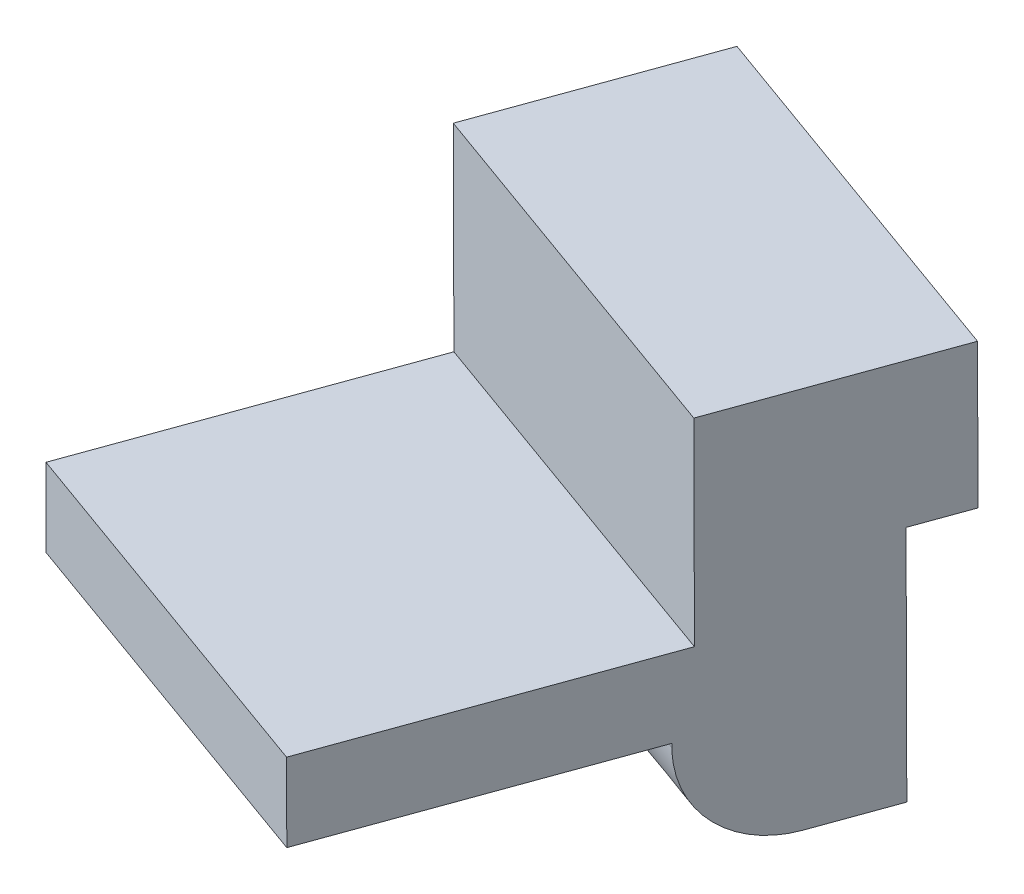
ISO-10303-21;
HEADER;
FILE_DESCRIPTION(('STEP AP214'),'2;1');
FILE_NAME('part.step','',(''),(''),'','','');
FILE_SCHEMA(('AUTOMOTIVE_DESIGN { 1 0 10303 214 1 1 1 1 }'));
ENDSEC;
DATA;
#1=APPLICATION_CONTEXT('core data for automotive mechanical design processes');
#2=APPLICATION_PROTOCOL_DEFINITION('international standard','automotive_design',2000,#1);
#3=PRODUCT_CONTEXT('',#1,'mechanical');
#4=PRODUCT('Part','Part','',(#3));
#5=PRODUCT_RELATED_PRODUCT_CATEGORY('part','',(#4));
#6=PRODUCT_DEFINITION_FORMATION('','',#4);
#7=PRODUCT_DEFINITION_CONTEXT('part definition',#1,'design');
#8=PRODUCT_DEFINITION('design','',#6,#7);
#9=PRODUCT_DEFINITION_SHAPE('','',#8);
#10=(LENGTH_UNIT() NAMED_UNIT(*) SI_UNIT(.MILLI.,.METRE.));
#11=(NAMED_UNIT(*) PLANE_ANGLE_UNIT() SI_UNIT($,.RADIAN.));
#12=(NAMED_UNIT(*) SI_UNIT($,.STERADIAN.) SOLID_ANGLE_UNIT());
#13=UNCERTAINTY_MEASURE_WITH_UNIT(LENGTH_MEASURE(1.E-05),#10,'distance_accuracy_value','');
#14=(GEOMETRIC_REPRESENTATION_CONTEXT(3) GLOBAL_UNCERTAINTY_ASSIGNED_CONTEXT((#13)) GLOBAL_UNIT_ASSIGNED_CONTEXT((#10,
#11,#12)) REPRESENTATION_CONTEXT('',''));
#15=CARTESIAN_POINT('',(0.,0.,0.));
#16=DIRECTION('',(0.,0.,1.));
#17=DIRECTION('',(1.,0.,0.));
#18=AXIS2_PLACEMENT_3D('',#15,#16,#17);
#19=CARTESIAN_POINT('',(190.1243935619,77.6598486218313,-222.834022890715));
#20=DIRECTION('',(-0.340654989155963,-0.000648546510536253,0.940188150186214));
#21=DIRECTION('',(0.00390183466063531,-0.999992125768939,0.000723938118281007));
#22=AXIS2_PLACEMENT_3D('',#19,#20,#21);
#23=PLANE('',#22);
#24=DIRECTION('',(-0.940180277419997,-0.00391507184373129,-0.340654837280959));
#25=VECTOR('',#24,1.);
#26=CARTESIAN_POINT('',(180.93032301511,84.6216215515205,-226.160475120867));
#27=LINE('',#26,#25);
#28=CARTESIAN_POINT('',(190.09708071977,84.6597935019978,-222.83909045722));
#29=VERTEX_POINT('',#28);
#30=CARTESIAN_POINT('',(171.763565309449,84.5834496010601,-229.481859784513));
#31=VERTEX_POINT('',#30);
#32=EDGE_CURVE('E35',#29,#31,#27,.T.);
#33=ORIENTED_EDGE('',*,*,#32,.F.);
#34=DIRECTION('',(0.00390183466064132,-0.999992125768939,0.000723938118264289));
#35=VECTOR('',#34,1.);
#36=CARTESIAN_POINT('',(190.110737140835,81.1598210619171,-222.836556674467));
#37=LINE('',#36,#35);
#38=CARTESIAN_POINT('',(190.1243935619,77.6598486218313,-222.834022890715));
#39=VERTEX_POINT('',#38);
#40=EDGE_CURVE('E11',#29,#39,#37,.T.);
#41=ORIENTED_EDGE('',*,*,#40,.T.);
#42=DIRECTION('',(-0.940180277419997,-0.00391507184373129,-0.340654837280959));
#43=VECTOR('',#42,1.);
#44=CARTESIAN_POINT('',(180.95763585724,77.621676671354,-226.155407554363));
#45=LINE('',#44,#43);
#46=CARTESIAN_POINT('',(171.79087815258,77.5835047208766,-229.47679221801));
#47=VERTEX_POINT('',#46);
#48=EDGE_CURVE('E27',#39,#47,#45,.T.);
#49=ORIENTED_EDGE('',*,*,#48,.T.);
#50=DIRECTION('',(0.00390183466064132,-0.999992125768939,0.000723938118264289));
#51=VECTOR('',#50,1.);
#52=CARTESIAN_POINT('',(171.777221731515,81.0834771609574,-229.479326000762));
#53=LINE('',#52,#51);
#54=EDGE_CURVE('E117',#31,#47,#53,.T.);
#55=ORIENTED_EDGE('',*,*,#54,.F.);
#56=EDGE_LOOP('',(#33,#41,#49,#55));
#57=FACE_BOUND('',#56,.T.);
#58=ADVANCED_FACE('F17',(#57),#23,.F.);
#59=CARTESIAN_POINT('',(189.194547742424,77.658078361247,-220.267701981886));
#60=DIRECTION('',(-0.00390183461032822,0.999992125769035,-0.000723938257071914));
#61=DIRECTION('',(-0.34065498915266,-0.000648546362894274,0.940188150187512));
#62=AXIS2_PLACEMENT_3D('',#59,#60,#61);
#63=PLANE('',#62);
#64=ORIENTED_EDGE('',*,*,#48,.F.);
#65=DIRECTION('',(-0.34065498915266,-0.000648546362876715,0.940188150187512));
#66=VECTOR('',#65,1.);
#67=CARTESIAN_POINT('',(189.659470651662,77.6589634915476,-221.5508624363));
#68=LINE('',#67,#66);
#69=CARTESIAN_POINT('',(189.194547742424,77.658078361247,-220.267701981886));
#70=VERTEX_POINT('',#69);
#71=EDGE_CURVE('E123',#39,#70,#68,.T.);
#72=ORIENTED_EDGE('',*,*,#71,.T.);
#73=DIRECTION('',(-0.940180277421394,-0.00391507184373613,-0.340654837277103));
#74=VECTOR('',#73,1.);
#75=CARTESIAN_POINT('',(180.027790037763,77.6199064107696,-223.589086645533));
#76=LINE('',#75,#74);
#77=CARTESIAN_POINT('',(170.861032332102,77.5817344603093,-226.910471309179));
#78=VERTEX_POINT('',#77);
#79=EDGE_CURVE('E127',#70,#78,#76,.T.);
#80=ORIENTED_EDGE('',*,*,#79,.T.);
#81=DIRECTION('',(-0.34065498915266,-0.000648546362876715,0.940188150187512));
#82=VECTOR('',#81,1.);
#83=CARTESIAN_POINT('',(171.325955242341,77.5826195905929,-228.193631763595));
#84=LINE('',#83,#82);
#85=EDGE_CURVE('E119',#47,#78,#84,.T.);
#86=ORIENTED_EDGE('',*,*,#85,.F.);
#87=EDGE_LOOP('',(#64,#72,#80,#86));
#88=FACE_BOUND('',#87,.T.);
#89=ADVANCED_FACE('F235',(#88),#63,.F.);
#90=CARTESIAN_POINT('',(189.239550660828,66.1243849164435,-220.259352235103));
#91=DIRECTION('',(-0.340654989145949,-0.000648546389706045,0.940188150189925));
#92=DIRECTION('',(0.00390183461948898,-0.999992125769018,0.00072393823184417));
#93=AXIS2_PLACEMENT_3D('',#90,#91,#92);
#94=PLANE('',#93);
#95=ORIENTED_EDGE('',*,*,#79,.F.);
#96=DIRECTION('',(0.00390183461949427,-0.999992125769018,0.000723938231829596));
#97=VECTOR('',#96,1.);
#98=CARTESIAN_POINT('',(189.217049201626,71.8912316388978,-220.263527108994));
#99=LINE('',#98,#97);
#100=CARTESIAN_POINT('',(189.239550660828,66.1243849164435,-220.259352235103));
#101=VERTEX_POINT('',#100);
#102=EDGE_CURVE('E130',#70,#101,#99,.T.);
#103=ORIENTED_EDGE('',*,*,#102,.T.);
#104=DIRECTION('',(-0.940180277423664,-0.00391507184371237,-0.340654837270838));
#105=VECTOR('',#104,1.);
#106=CARTESIAN_POINT('',(180.072792956168,66.0862129659612,-223.580736897751));
#107=LINE('',#106,#105);
#108=CARTESIAN_POINT('',(170.906035251507,66.0480410154838,-226.902121561398));
#109=VERTEX_POINT('',#108);
#110=EDGE_CURVE('E135',#101,#109,#107,.T.);
#111=ORIENTED_EDGE('',*,*,#110,.T.);
#112=DIRECTION('',(0.00390183461949427,-0.999992125769018,0.000723938231829596));
#113=VECTOR('',#112,1.);
#114=CARTESIAN_POINT('',(170.883533792306,71.814887737938,-226.906296435289));
#115=LINE('',#114,#113);
#116=EDGE_CURVE('E132',#78,#109,#115,.T.);
#117=ORIENTED_EDGE('',*,*,#116,.F.);
#118=EDGE_LOOP('',(#95,#103,#111,#117));
#119=FACE_BOUND('',#118,.T.);
#120=ADVANCED_FACE('F239',(#119),#94,.F.);
#121=CARTESIAN_POINT('',(187.893963454222,66.1218231581741,-216.545609041848));
#122=DIRECTION('',(-0.00390183462676691,0.999992125769004,-0.000723938211509815));
#123=DIRECTION('',(-0.340654989152249,-0.000648546411329851,0.940188150187628));
#124=AXIS2_PLACEMENT_3D('',#121,#122,#123);
#125=PLANE('',#124);
#126=ORIENTED_EDGE('',*,*,#110,.F.);
#127=DIRECTION('',(-0.340654989152249,-0.000648546411350677,0.940188150187628));
#128=VECTOR('',#127,1.);
#129=CARTESIAN_POINT('',(188.566757057025,66.1231040373148,-218.402480637975));
#130=LINE('',#129,#128);
#131=CARTESIAN_POINT('',(187.893963454222,66.1218231581741,-216.545609041848));
#132=VERTEX_POINT('',#131);
#133=EDGE_CURVE('E138',#101,#132,#130,.T.);
#134=ORIENTED_EDGE('',*,*,#133,.T.);
#135=DIRECTION('',(-0.940180277421394,-0.00391507184373613,-0.340654837277103));
#136=VECTOR('',#135,1.);
#137=CARTESIAN_POINT('',(178.727205749562,66.0836512076968,-219.866993705495));
#138=LINE('',#137,#136);
#139=CARTESIAN_POINT('',(169.560448043901,66.0454792572364,-223.188378369141));
#140=VERTEX_POINT('',#139);
#141=EDGE_CURVE('E143',#132,#140,#138,.T.);
#142=ORIENTED_EDGE('',*,*,#141,.T.);
#143=DIRECTION('',(-0.340654989152249,-0.000648546411350677,0.940188150187628));
#144=VECTOR('',#143,1.);
#145=CARTESIAN_POINT('',(170.233241647705,66.0467601363601,-225.04524996527));
#146=LINE('',#145,#144);
#147=EDGE_CURVE('E140',#109,#140,#146,.T.);
#148=ORIENTED_EDGE('',*,*,#147,.F.);
#149=EDGE_LOOP('',(#126,#134,#142,#148));
#150=FACE_BOUND('',#149,.T.);
#151=ADVANCED_FACE('F165',(#150),#125,.F.);
#152=CARTESIAN_POINT('',(186.188407176309,71.0685738759847,-211.895261193052));
#153=CARTESIAN_POINT('',(186.194474873758,69.5134977575954,-211.894135405244));
#154=CARTESIAN_POINT('',(186.407981323689,67.9573656585796,-212.46551194947));
#155=CARTESIAN_POINT('',(186.831596054553,66.7287245983908,-213.620534435435));
#156=CARTESIAN_POINT('',(187.364214844212,66.1208146111974,-215.083533389898));
#157=CARTESIAN_POINT('',(187.893963454222,66.1218231581741,-216.545609041848));
#158=B_SPLINE_CURVE_WITH_KNOTS('',5,(#152,#153,#154,#155,#156,#157),.UNSPECIFIED.,.F.,.F.,(6,6),
(0.,1.),.UNSPECIFIED.);
#159=DIRECTION('',(-0.940180277421394,-0.00391507184373613,-0.340654837277103));
#160=VECTOR('',#159,1.);
#161=SURFACE_OF_LINEAR_EXTRUSION('',#158,#160);
#162=ORIENTED_EDGE('',*,*,#141,.F.);
#163=CARTESIAN_POINT('',(187.893963454222,66.1218231581741,-216.545609041848));
#164=CARTESIAN_POINT('',(187.364214844212,66.1208146111974,-215.083533389898));
#165=CARTESIAN_POINT('',(186.831596054553,66.7287245983908,-213.620534435435));
#166=CARTESIAN_POINT('',(186.407981323689,67.9573656585796,-212.46551194947));
#167=CARTESIAN_POINT('',(186.194474873758,69.5134977575954,-211.894135405244));
#168=CARTESIAN_POINT('',(186.188407176309,71.0685738759847,-211.895261193052));
#169=B_SPLINE_CURVE_WITH_KNOTS('',5,(#163,#164,#165,#166,#167,#168),.UNSPECIFIED.,.F.,.F.,(6,6),
(0.,1.),.UNSPECIFIED.);
#170=CARTESIAN_POINT('',(186.188407176309,71.0685738759847,-211.895261193052));
#171=VERTEX_POINT('',#170);
#172=EDGE_CURVE('E146',#132,#171,#169,.T.);
#173=ORIENTED_EDGE('',*,*,#172,.T.);
#174=DIRECTION('',(-0.940180277421394,-0.00391507184373613,-0.340654837277103));
#175=VECTOR('',#174,1.);
#176=CARTESIAN_POINT('',(177.02164947165,71.0304019255023,-215.216645855699));
#177=LINE('',#176,#175);
#178=CARTESIAN_POINT('',(167.85489176699,70.992229975025,-218.538030519346));
#179=VERTEX_POINT('',#178);
#180=EDGE_CURVE('E189',#171,#179,#177,.T.);
#181=ORIENTED_EDGE('',*,*,#180,.T.);
#182=CARTESIAN_POINT('',(169.560448043901,66.0454792572364,-223.188378369141));
#183=CARTESIAN_POINT('',(169.030699434891,66.0444707102428,-221.726302717193));
#184=CARTESIAN_POINT('',(168.498080644232,66.6523806974531,-220.263303762728));
#185=CARTESIAN_POINT('',(168.074465913368,67.8810217576419,-219.108281276763));
#186=CARTESIAN_POINT('',(167.860959464438,69.4371538566357,-218.536904731539));
#187=CARTESIAN_POINT('',(167.85489176699,70.992229975025,-218.538030519346));
#188=B_SPLINE_CURVE_WITH_KNOTS('',5,(#182,#183,#184,#185,#186,#187),.UNSPECIFIED.,.F.,.F.,(6,6),
(0.,1.),.UNSPECIFIED.);
#189=EDGE_CURVE('E148',#140,#179,#188,.T.);
#190=ORIENTED_EDGE('',*,*,#189,.F.);
#191=EDGE_LOOP('',(#162,#173,#181,#190));
#192=FACE_BOUND('',#191,.T.);
#193=ADVANCED_FACE('F160',(#192),#161,.F.);
#194=CARTESIAN_POINT('',(186.188852722872,71.2523589066336,-211.898603065746));
#195=CARTESIAN_POINT('',(186.188531072194,71.2156183568569,-211.897293086242));
#196=CARTESIAN_POINT('',(186.188325681953,71.1788653544517,-211.896303832351));
#197=CARTESIAN_POINT('',(186.188236562692,71.1421041237842,-211.895635380842));
#198=CARTESIAN_POINT('',(186.188263723963,71.1053388894381,-211.895287808487));
#199=CARTESIAN_POINT('',(186.188407176309,71.0685738759847,-211.895261193052));
#200=B_SPLINE_CURVE_WITH_KNOTS('',5,(#194,#195,#196,#197,#198,#199),.UNSPECIFIED.,.F.,.F.,(6,6),
(0.,1.),.UNSPECIFIED.);
#201=DIRECTION('',(-0.940180277421394,-0.00391507184373613,-0.340654837277103));
#202=VECTOR('',#201,1.);
#203=SURFACE_OF_LINEAR_EXTRUSION('',#200,#202);
#204=ORIENTED_EDGE('',*,*,#180,.F.);
#205=CARTESIAN_POINT('',(186.188407176309,71.0685738759847,-211.895261193052));
#206=CARTESIAN_POINT('',(186.188263723963,71.1053388894381,-211.895287808487));
#207=CARTESIAN_POINT('',(186.188236562692,71.1421041237842,-211.895635380842));
#208=CARTESIAN_POINT('',(186.188325681953,71.1788653544517,-211.896303832351));
#209=CARTESIAN_POINT('',(186.188531072194,71.2156183568569,-211.897293086242));
#210=CARTESIAN_POINT('',(186.188852722872,71.2523589066336,-211.898603065746));
#211=B_SPLINE_CURVE_WITH_KNOTS('',5,(#205,#206,#207,#208,#209,#210),.UNSPECIFIED.,.F.,.F.,(6,6),
(0.,1.),.UNSPECIFIED.);
#212=CARTESIAN_POINT('',(186.188852722872,71.2523589066336,-211.898603065746));
#213=VERTEX_POINT('',#212);
#214=EDGE_CURVE('E181',#171,#213,#211,.T.);
#215=ORIENTED_EDGE('',*,*,#214,.T.);
#216=DIRECTION('',(-0.940180277421394,-0.00391507184373613,-0.340654837277103));
#217=VECTOR('',#216,1.);
#218=CARTESIAN_POINT('',(177.022095017212,71.2141869561732,-215.219987729393));
#219=LINE('',#218,#217);
#220=CARTESIAN_POINT('',(167.855337312551,71.1760150056958,-218.54137239304));
#221=VERTEX_POINT('',#220);
#222=EDGE_CURVE('E190',#213,#221,#219,.T.);
#223=ORIENTED_EDGE('',*,*,#222,.T.);
#224=CARTESIAN_POINT('',(167.85489176699,70.992229975025,-218.538030519346));
#225=CARTESIAN_POINT('',(167.854748314642,71.0289949884834,-218.538057135781));
#226=CARTESIAN_POINT('',(167.854721153372,71.0657602228245,-218.538404707137));
#227=CARTESIAN_POINT('',(167.854810272633,71.1025214534919,-218.539073158645));
#228=CARTESIAN_POINT('',(167.855015662875,71.1392744558972,-218.540062412537));
#229=CARTESIAN_POINT('',(167.855337312551,71.1760150056958,-218.54137239304));
#230=B_SPLINE_CURVE_WITH_KNOTS('',5,(#224,#225,#226,#227,#228,#229),.UNSPECIFIED.,.F.,.F.,(6,6),
(0.,1.),.UNSPECIFIED.);
#231=EDGE_CURVE('E197',#179,#221,#230,.T.);
#232=ORIENTED_EDGE('',*,*,#231,.F.);
#233=EDGE_LOOP('',(#204,#215,#223,#232));
#234=FACE_BOUND('',#233,.T.);
#235=ADVANCED_FACE('F164',(#234),#203,.F.);
#236=CARTESIAN_POINT('',(181.209729101075,71.2428795423316,-198.15650864081));
#237=DIRECTION('',(-0.00390183462676693,0.999992125769004,-0.000723938211519815));
#238=DIRECTION('',(-0.340654989152249,-0.000648546411320456,0.940188150187628));
#239=AXIS2_PLACEMENT_3D('',#236,#237,#238);
#240=PLANE('',#239);
#241=ORIENTED_EDGE('',*,*,#222,.F.);
#242=DIRECTION('',(-0.340654989152249,-0.000648546411340679,0.940188150187628));
#243=VECTOR('',#242,1.);
#244=CARTESIAN_POINT('',(183.699290911474,71.2476192244886,-205.027555852778));
#245=LINE('',#244,#243);
#246=CARTESIAN_POINT('',(181.209729101075,71.2428795423316,-198.15650864081));
#247=VERTEX_POINT('',#246);
#248=EDGE_CURVE('E196',#213,#247,#245,.T.);
#249=ORIENTED_EDGE('',*,*,#248,.T.);
#250=DIRECTION('',(-0.940180277421394,-0.00391507184373613,-0.340654837277103));
#251=VECTOR('',#250,1.);
#252=CARTESIAN_POINT('',(172.042971396415,71.2047075918542,-201.477893304457));
#253=LINE('',#252,#251);
#254=CARTESIAN_POINT('',(162.876213690755,71.1665356413888,-204.799277967103));
#255=VERTEX_POINT('',#254);
#256=EDGE_CURVE('E207',#247,#255,#253,.T.);
#257=ORIENTED_EDGE('',*,*,#256,.T.);
#258=DIRECTION('',(-0.340654989152249,-0.000648546411340679,0.940188150187628));
#259=VECTOR('',#258,1.);
#260=CARTESIAN_POINT('',(165.365775502154,71.1712753235338,-211.670325180072));
#261=LINE('',#260,#259);
#262=EDGE_CURVE('E201',#221,#255,#261,.T.);
#263=ORIENTED_EDGE('',*,*,#262,.F.);
#264=EDGE_LOOP('',(#241,#249,#257,#263));
#265=FACE_BOUND('',#264,.T.);
#266=ADVANCED_FACE('F171',(#265),#240,.F.);
#267=CARTESIAN_POINT('',(181.194902129159,75.0428496208546,-198.159259605794));
#268=DIRECTION('',(0.340654989152248,0.000648546411300685,-0.940188150187628));
#269=DIRECTION('',(-0.00390183462677307,0.999992125769004,-0.000723938211543066));
#270=AXIS2_PLACEMENT_3D('',#267,#268,#269);
#271=PLANE('',#270);
#272=ORIENTED_EDGE('',*,*,#256,.F.);
#273=DIRECTION('',(-0.00390183462676697,0.999992125769004,-0.000723938211559815));
#274=VECTOR('',#273,1.);
#275=CARTESIAN_POINT('',(181.202315614618,73.1428645816016,-198.157884123302));
#276=LINE('',#275,#274);
#277=CARTESIAN_POINT('',(181.194902129159,75.0428496208546,-198.159259605794));
#278=VERTEX_POINT('',#277);
#279=EDGE_CURVE('E210',#247,#278,#276,.T.);
#280=ORIENTED_EDGE('',*,*,#279,.T.);
#281=DIRECTION('',(-0.940180277421394,-0.00391507184373613,-0.340654837277103));
#282=VECTOR('',#281,1.);
#283=CARTESIAN_POINT('',(172.028144424498,75.0046776703772,-201.480644269441));
#284=LINE('',#283,#282);
#285=CARTESIAN_POINT('',(162.861386719838,74.9665057198999,-204.802028933088));
#286=VERTEX_POINT('',#285);
#287=EDGE_CURVE('E215',#278,#286,#284,.T.);
#288=ORIENTED_EDGE('',*,*,#287,.T.);
#289=DIRECTION('',(-0.00390183462676697,0.999992125769004,-0.000723938211559815));
#290=VECTOR('',#289,1.);
#291=CARTESIAN_POINT('',(162.868800205298,73.0665206806418,-204.800653449596));
#292=LINE('',#291,#290);
#293=EDGE_CURVE('E212',#255,#286,#292,.T.);
#294=ORIENTED_EDGE('',*,*,#293,.F.);
#295=EDGE_LOOP('',(#272,#280,#288,#294));
#296=FACE_BOUND('',#295,.T.);
#297=ADVANCED_FACE('F253',(#296),#271,.F.);
#298=CARTESIAN_POINT('',(186.467330919336,75.0528873853609,-212.710859402802));
#299=DIRECTION('',(0.00390183461480043,-0.999992125769033,0.000723938235886043));
#300=DIRECTION('',(0.340654989152691,0.000648546384336769,-0.940188150187486));
#301=AXIS2_PLACEMENT_3D('',#298,#299,#300);
#302=PLANE('',#301);
#303=ORIENTED_EDGE('',*,*,#287,.F.);
#304=DIRECTION('',(0.34065498915269,0.00064854638434775,-0.940188150187487));
#305=VECTOR('',#304,1.);
#306=CARTESIAN_POINT('',(183.831116523745,75.0478685030188,-205.435059504797));
#307=LINE('',#306,#305);
#308=CARTESIAN_POINT('',(186.467330919336,75.0528873853609,-212.710859402802));
#309=VERTEX_POINT('',#308);
#310=EDGE_CURVE('E218',#278,#309,#307,.T.);
#311=ORIENTED_EDGE('',*,*,#310,.T.);
#312=DIRECTION('',(-0.940180277421404,-0.00391507184073686,-0.34065483727711));
#313=VECTOR('',#312,1.);
#314=CARTESIAN_POINT('',(177.300573214675,75.0147154348836,-216.032244066449));
#315=LINE('',#314,#313);
#316=CARTESIAN_POINT('',(168.133815509015,74.9765434844232,-219.353628730095));
#317=VERTEX_POINT('',#316);
#318=EDGE_CURVE('E222',#309,#317,#315,.T.);
#319=ORIENTED_EDGE('',*,*,#318,.T.);
#320=DIRECTION('',(0.34065498915269,0.00064854638434775,-0.940188150187487));
#321=VECTOR('',#320,1.);
#322=CARTESIAN_POINT('',(165.497601114425,74.971524602059,-212.077828831092));
#323=LINE('',#322,#321);
#324=EDGE_CURVE('E106',#286,#317,#323,.T.);
#325=ORIENTED_EDGE('',*,*,#324,.F.);
#326=EDGE_LOOP('',(#303,#311,#319,#325));
#327=FACE_BOUND('',#326,.T.);
#328=ADVANCED_FACE('F226',(#327),#302,.F.);
#329=CARTESIAN_POINT('',(186.429873306728,84.6528117925352,-212.71780920935));
#330=DIRECTION('',(0.340654989157038,0.000648546394698534,-0.940188150185904));
#331=DIRECTION('',(-0.00390183462118112,0.999992125769014,-0.000723938227196343));
#332=AXIS2_PLACEMENT_3D('',#329,#330,#331);
#333=PLANE('',#332);
#334=ORIENTED_EDGE('',*,*,#318,.F.);
#335=DIRECTION('',(-0.00390183462118799,0.999992125769014,-0.000723938227177318));
#336=VECTOR('',#335,1.);
#337=CARTESIAN_POINT('',(186.448602112531,79.8528495889591,-212.714334306575));
#338=LINE('',#337,#336);
#339=CARTESIAN_POINT('',(186.429873306728,84.6528117925352,-212.71780920935));
#340=VERTEX_POINT('',#339);
#341=EDGE_CURVE('E112',#309,#340,#338,.T.);
#342=ORIENTED_EDGE('',*,*,#341,.T.);
#343=DIRECTION('',(-0.940180277419677,-0.00391507184372489,-0.340654837281842));
#344=VECTOR('',#343,1.);
#345=CARTESIAN_POINT('',(177.263115602067,84.6146398420579,-216.039193872997));
#346=LINE('',#345,#344);
#347=CARTESIAN_POINT('',(168.096357897407,84.5764678915805,-219.360578536644));
#348=VERTEX_POINT('',#347);
#349=EDGE_CURVE('E98',#340,#348,#346,.T.);
#350=ORIENTED_EDGE('',*,*,#349,.T.);
#351=DIRECTION('',(-0.00390183462118799,0.999992125769014,-0.000723938227177318));
#352=VECTOR('',#351,1.);
#353=CARTESIAN_POINT('',(168.115086703211,79.7765056879993,-219.35710363287));
#354=LINE('',#353,#352);
#355=EDGE_CURVE('E104',#317,#348,#354,.T.);
#356=ORIENTED_EDGE('',*,*,#355,.F.);
#357=EDGE_LOOP('',(#334,#342,#350,#356));
#358=FACE_BOUND('',#357,.T.);
#359=ADVANCED_FACE('F110',(#358),#333,.F.);
#360=CARTESIAN_POINT('',(190.097080719775,84.6597935024028,-222.839090458217));
#361=DIRECTION('',(0.00390183463175137,-0.999992125768993,0.000723938200103084));
#362=DIRECTION('',(0.340654989152453,0.000648546423753269,-0.940188150187545));
#363=AXIS2_PLACEMENT_3D('',#360,#361,#362);
#364=PLANE('',#363);
#365=ORIENTED_EDGE('',*,*,#349,.F.);
#366=DIRECTION('',(0.340654989152453,0.000648546423758729,-0.940188150187546));
#367=VECTOR('',#366,1.);
#368=CARTESIAN_POINT('',(188.263477013251,84.6563026474715,-217.778449834284));
#369=LINE('',#368,#367);
#370=EDGE_CURVE('E114',#340,#29,#369,.T.);
#371=ORIENTED_EDGE('',*,*,#370,.T.);
#372=ORIENTED_EDGE('',*,*,#32,.T.);
#373=DIRECTION('',(0.340654989152453,0.000648546423758729,-0.940188150187546));
#374=VECTOR('',#373,1.);
#375=CARTESIAN_POINT('',(169.929961603931,84.5799587465118,-224.421219160578));
#376=LINE('',#375,#374);
#377=EDGE_CURVE('E21',#348,#31,#376,.T.);
#378=ORIENTED_EDGE('',*,*,#377,.F.);
#379=EDGE_LOOP('',(#365,#371,#372,#378));
#380=FACE_BOUND('',#379,.T.);
#381=ADVANCED_FACE('F116',(#380),#364,.F.);
#382=CARTESIAN_POINT('',(104.378119884223,15.784802593811,14.5299942221679));
#383=DIRECTION('',(-0.940180277421394,-0.00391507184373613,-0.340654837277103));
#384=DIRECTION('',(0.005988940421434,-0.999969382312462,-0.00503656929491547));
#385=AXIS2_PLACEMENT_3D('',#382,#383,#384);
#386=PLANE('',#385);
#387=ORIENTED_EDGE('',*,*,#370,.F.);
#388=ORIENTED_EDGE('',*,*,#341,.F.);
#389=ORIENTED_EDGE('',*,*,#310,.F.);
#390=ORIENTED_EDGE('',*,*,#279,.F.);
#391=ORIENTED_EDGE('',*,*,#248,.F.);
#392=ORIENTED_EDGE('',*,*,#214,.F.);
#393=ORIENTED_EDGE('',*,*,#172,.F.);
#394=ORIENTED_EDGE('',*,*,#133,.F.);
#395=ORIENTED_EDGE('',*,*,#102,.F.);
#396=ORIENTED_EDGE('',*,*,#71,.F.);
#397=ORIENTED_EDGE('',*,*,#40,.F.);
#398=EDGE_LOOP('',(#387,#388,#389,#390,#391,#392,#393,#394,#395,#396,#397));
#399=FACE_BOUND('',#398,.T.);
#400=ADVANCED_FACE('F230',(#399),#386,.F.);
#401=CARTESIAN_POINT('',(86.0446044742027,15.7084586928661,7.88722489527435));
#402=DIRECTION('',(-0.940180277421394,-0.00391507184373613,-0.340654837277103));
#403=DIRECTION('',(0.005988940421434,-0.999969382312462,-0.00503656929491547));
#404=AXIS2_PLACEMENT_3D('',#401,#402,#403);
#405=PLANE('',#404);
#406=ORIENTED_EDGE('',*,*,#54,.T.);
#407=ORIENTED_EDGE('',*,*,#85,.T.);
#408=ORIENTED_EDGE('',*,*,#116,.T.);
#409=ORIENTED_EDGE('',*,*,#147,.T.);
#410=ORIENTED_EDGE('',*,*,#189,.T.);
#411=ORIENTED_EDGE('',*,*,#231,.T.);
#412=ORIENTED_EDGE('',*,*,#262,.T.);
#413=ORIENTED_EDGE('',*,*,#293,.T.);
#414=ORIENTED_EDGE('',*,*,#324,.T.);
#415=ORIENTED_EDGE('',*,*,#355,.T.);
#416=ORIENTED_EDGE('',*,*,#377,.T.);
#417=EDGE_LOOP('',(#406,#407,#408,#409,#410,#411,#412,#413,#414,#415,#416));
#418=FACE_BOUND('',#417,.T.);
#419=ADVANCED_FACE('F19',(#418),#405,.T.);
#420=CLOSED_SHELL('',(#58,#89,#120,#151,#193,#235,#266,#297,#328,#359,#381,#400,#419));
#421=MANIFOLD_SOLID_BREP('B1',#420);
#422=ADVANCED_BREP_SHAPE_REPRESENTATION('',(#18,#421),#14);
#423=SHAPE_DEFINITION_REPRESENTATION(#9,#422);
ENDSEC;
END-ISO-10303-21;
